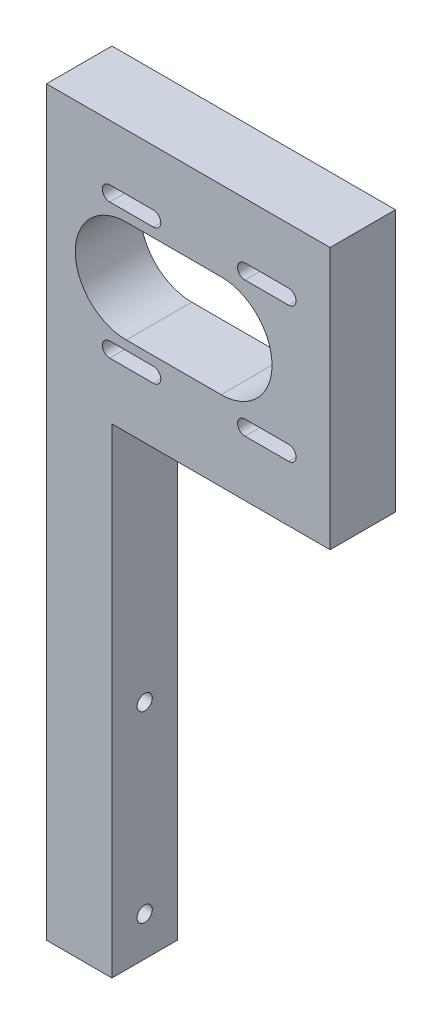
ISO-10303-21;
HEADER;
FILE_DESCRIPTION(('STEP AP214'),'2;1');
FILE_NAME('part.step','',(''),(''),'','','');
FILE_SCHEMA(('AUTOMOTIVE_DESIGN { 1 0 10303 214 1 1 1 1 }'));
ENDSEC;
DATA;
#1=APPLICATION_CONTEXT('core data for automotive mechanical design processes');
#2=APPLICATION_PROTOCOL_DEFINITION('international standard','automotive_design',2000,#1);
#3=PRODUCT_CONTEXT('',#1,'mechanical');
#4=PRODUCT('Part','Part','',(#3));
#5=PRODUCT_RELATED_PRODUCT_CATEGORY('part','',(#4));
#6=PRODUCT_DEFINITION_FORMATION('','',#4);
#7=PRODUCT_DEFINITION_CONTEXT('part definition',#1,'design');
#8=PRODUCT_DEFINITION('design','',#6,#7);
#9=PRODUCT_DEFINITION_SHAPE('','',#8);
#10=(LENGTH_UNIT() NAMED_UNIT(*) SI_UNIT(.MILLI.,.METRE.));
#11=(NAMED_UNIT(*) PLANE_ANGLE_UNIT() SI_UNIT($,.RADIAN.));
#12=(NAMED_UNIT(*) SI_UNIT($,.STERADIAN.) SOLID_ANGLE_UNIT());
#13=UNCERTAINTY_MEASURE_WITH_UNIT(LENGTH_MEASURE(1.E-05),#10,'distance_accuracy_value','');
#14=(GEOMETRIC_REPRESENTATION_CONTEXT(3) GLOBAL_UNCERTAINTY_ASSIGNED_CONTEXT((#13)) GLOBAL_UNIT_ASSIGNED_CONTEXT((#10,
#11,#12)) REPRESENTATION_CONTEXT('',''));
#15=CARTESIAN_POINT('',(0.,0.,0.));
#16=DIRECTION('',(0.,0.,1.));
#17=DIRECTION('',(1.,0.,0.));
#18=AXIS2_PLACEMENT_3D('',#15,#16,#17);
#19=CARTESIAN_POINT('',(7.5,170.,-7.5));
#20=DIRECTION('',(-1.,0.,0.));
#21=DIRECTION('',(0.,0.,1.));
#22=AXIS2_PLACEMENT_3D('',#19,#20,#21);
#23=PLANE('',#22);
#24=CARTESIAN_POINT('',(7.5,9.,0.));
#25=DIRECTION('',(1.,0.,0.));
#26=DIRECTION('',(0.,0.,-1.));
#27=AXIS2_PLACEMENT_3D('',#24,#25,#26);
#28=CIRCLE('',#27,1.75);
#29=CARTESIAN_POINT('',(7.5,9.,-1.75));
#30=VERTEX_POINT('',#29);
#31=EDGE_CURVE('E418',#30,#30,#28,.T.);
#32=ORIENTED_EDGE('',*,*,#31,.F.);
#33=EDGE_LOOP('',(#32));
#34=FACE_BOUND('',#33,.T.);
#35=CARTESIAN_POINT('',(7.5,51.,0.));
#36=DIRECTION('',(1.,0.,0.));
#37=DIRECTION('',(0.,0.,-1.));
#38=AXIS2_PLACEMENT_3D('',#35,#36,#37);
#39=CIRCLE('',#38,1.75);
#40=CARTESIAN_POINT('',(7.5,51.,-1.75));
#41=VERTEX_POINT('',#40);
#42=EDGE_CURVE('E410',#41,#41,#39,.T.);
#43=ORIENTED_EDGE('',*,*,#42,.F.);
#44=EDGE_LOOP('',(#43));
#45=FACE_BOUND('',#44,.T.);
#46=DIRECTION('',(0.,0.,-1.));
#47=VECTOR('',#46,1.);
#48=CARTESIAN_POINT('',(7.5,110.,7.49999999999999));
#49=LINE('',#48,#47);
#50=CARTESIAN_POINT('',(7.5,110.,7.5));
#51=VERTEX_POINT('',#50);
#52=CARTESIAN_POINT('',(7.5,110.,-7.5));
#53=VERTEX_POINT('',#52);
#54=EDGE_CURVE('E382',#51,#53,#49,.T.);
#55=ORIENTED_EDGE('',*,*,#54,.F.);
#56=DIRECTION('',(0.,-1.,0.));
#57=VECTOR('',#56,1.);
#58=CARTESIAN_POINT('',(7.5,170.,7.5));
#59=LINE('',#58,#57);
#60=CARTESIAN_POINT('',(7.5,0.,7.5));
#61=VERTEX_POINT('',#60);
#62=EDGE_CURVE('E403',#51,#61,#59,.T.);
#63=ORIENTED_EDGE('',*,*,#62,.T.);
#64=DIRECTION('',(0.,0.,-1.));
#65=VECTOR('',#64,1.);
#66=CARTESIAN_POINT('',(7.5,0.,-7.5));
#67=LINE('',#66,#65);
#68=CARTESIAN_POINT('',(7.5,0.,-7.5));
#69=VERTEX_POINT('',#68);
#70=EDGE_CURVE('E423',#61,#69,#67,.T.);
#71=ORIENTED_EDGE('',*,*,#70,.T.);
#72=DIRECTION('',(0.,-1.,0.));
#73=VECTOR('',#72,1.);
#74=CARTESIAN_POINT('',(7.5,170.,-7.5));
#75=LINE('',#74,#73);
#76=EDGE_CURVE('E11',#53,#69,#75,.T.);
#77=ORIENTED_EDGE('',*,*,#76,.F.);
#78=EDGE_LOOP('',(#55,#63,#71,#77));
#79=FACE_BOUND('',#78,.T.);
#80=ADVANCED_FACE('F34',(#34,#45,#79),#23,.F.);
#81=CARTESIAN_POINT('',(7.5,170.,-7.5));
#82=DIRECTION('',(0.,0.,1.));
#83=DIRECTION('',(1.,0.,0.));
#84=AXIS2_PLACEMENT_3D('',#81,#82,#83);
#85=PLANE('',#84);
#86=DIRECTION('',(1.,0.,0.));
#87=VECTOR('',#86,1.);
#88=CARTESIAN_POINT('',(7.5,153.8,-7.5));
#89=LINE('',#88,#87);
#90=CARTESIAN_POINT('',(7.,153.8,-7.5));
#91=VERTEX_POINT('',#90);
#92=CARTESIAN_POINT('',(17.,153.8,-7.5));
#93=VERTEX_POINT('',#92);
#94=EDGE_CURVE('E238',#91,#93,#89,.T.);
#95=ORIENTED_EDGE('',*,*,#94,.T.);
#96=CARTESIAN_POINT('',(17.,155.5,-7.5));
#97=DIRECTION('',(0.,0.,1.));
#98=DIRECTION('',(1.,0.,0.));
#99=AXIS2_PLACEMENT_3D('',#96,#97,#98);
#100=CIRCLE('',#99,1.70000000000001);
#101=CARTESIAN_POINT('',(17.,157.2,-7.5));
#102=VERTEX_POINT('',#101);
#103=EDGE_CURVE('E241',#93,#102,#100,.T.);
#104=ORIENTED_EDGE('',*,*,#103,.T.);
#105=DIRECTION('',(-1.,0.,0.));
#106=VECTOR('',#105,1.);
#107=CARTESIAN_POINT('',(7.5,157.2,-7.5));
#108=LINE('',#107,#106);
#109=CARTESIAN_POINT('',(7.,157.2,-7.5));
#110=VERTEX_POINT('',#109);
#111=EDGE_CURVE('E233',#102,#110,#108,.T.);
#112=ORIENTED_EDGE('',*,*,#111,.T.);
#113=CARTESIAN_POINT('',(7.,155.5,-7.5));
#114=DIRECTION('',(0.,0.,1.));
#115=DIRECTION('',(1.,0.,0.));
#116=AXIS2_PLACEMENT_3D('',#113,#114,#115);
#117=CIRCLE('',#116,1.70000000000001);
#118=EDGE_CURVE('E213',#110,#91,#117,.T.);
#119=ORIENTED_EDGE('',*,*,#118,.T.);
#120=EDGE_LOOP('',(#95,#104,#112,#119));
#121=FACE_BOUND('',#120,.T.);
#122=DIRECTION('',(1.,0.,0.));
#123=VECTOR('',#122,1.);
#124=CARTESIAN_POINT('',(7.5,153.8,-7.5));
#125=LINE('',#124,#123);
#126=CARTESIAN_POINT('',(38.,153.8,-7.5));
#127=VERTEX_POINT('',#126);
#128=CARTESIAN_POINT('',(48.,153.8,-7.5));
#129=VERTEX_POINT('',#128);
#130=EDGE_CURVE('E270',#127,#129,#125,.T.);
#131=ORIENTED_EDGE('',*,*,#130,.T.);
#132=CARTESIAN_POINT('',(48.,155.5,-7.5));
#133=DIRECTION('',(0.,0.,1.));
#134=DIRECTION('',(1.,0.,0.));
#135=AXIS2_PLACEMENT_3D('',#132,#133,#134);
#136=CIRCLE('',#135,1.70000000000001);
#137=CARTESIAN_POINT('',(48.,157.2,-7.5));
#138=VERTEX_POINT('',#137);
#139=EDGE_CURVE('E273',#129,#138,#136,.T.);
#140=ORIENTED_EDGE('',*,*,#139,.T.);
#141=DIRECTION('',(-1.,0.,0.));
#142=VECTOR('',#141,1.);
#143=CARTESIAN_POINT('',(7.5,157.2,-7.5));
#144=LINE('',#143,#142);
#145=CARTESIAN_POINT('',(38.,157.2,-7.5));
#146=VERTEX_POINT('',#145);
#147=EDGE_CURVE('E258',#138,#146,#144,.T.);
#148=ORIENTED_EDGE('',*,*,#147,.T.);
#149=CARTESIAN_POINT('',(38.,155.5,-7.5));
#150=DIRECTION('',(0.,0.,1.));
#151=DIRECTION('',(1.,0.,0.));
#152=AXIS2_PLACEMENT_3D('',#149,#150,#151);
#153=CIRCLE('',#152,1.70000000000001);
#154=EDGE_CURVE('E267',#146,#127,#153,.T.);
#155=ORIENTED_EDGE('',*,*,#154,.T.);
#156=EDGE_LOOP('',(#131,#140,#148,#155));
#157=FACE_BOUND('',#156,.T.);
#158=DIRECTION('',(1.,0.,0.));
#159=VECTOR('',#158,1.);
#160=CARTESIAN_POINT('',(7.5,122.8,-7.5));
#161=LINE('',#160,#159);
#162=CARTESIAN_POINT('',(38.,122.8,-7.5));
#163=VERTEX_POINT('',#162);
#164=CARTESIAN_POINT('',(48.,122.8,-7.5));
#165=VERTEX_POINT('',#164);
#166=EDGE_CURVE('E302',#163,#165,#161,.T.);
#167=ORIENTED_EDGE('',*,*,#166,.T.);
#168=CARTESIAN_POINT('',(48.,124.5,-7.5));
#169=DIRECTION('',(0.,0.,1.));
#170=DIRECTION('',(1.,0.,0.));
#171=AXIS2_PLACEMENT_3D('',#168,#169,#170);
#172=CIRCLE('',#171,1.70000000000001);
#173=CARTESIAN_POINT('',(48.,126.2,-7.5));
#174=VERTEX_POINT('',#173);
#175=EDGE_CURVE('E305',#165,#174,#172,.T.);
#176=ORIENTED_EDGE('',*,*,#175,.T.);
#177=DIRECTION('',(-1.,0.,0.));
#178=VECTOR('',#177,1.);
#179=CARTESIAN_POINT('',(7.5,126.2,-7.5));
#180=LINE('',#179,#178);
#181=CARTESIAN_POINT('',(38.,126.2,-7.5));
#182=VERTEX_POINT('',#181);
#183=EDGE_CURVE('E290',#174,#182,#180,.T.);
#184=ORIENTED_EDGE('',*,*,#183,.T.);
#185=CARTESIAN_POINT('',(38.,124.5,-7.5));
#186=DIRECTION('',(0.,0.,1.));
#187=DIRECTION('',(1.,0.,0.));
#188=AXIS2_PLACEMENT_3D('',#185,#186,#187);
#189=CIRCLE('',#188,1.70000000000001);
#190=EDGE_CURVE('E299',#182,#163,#189,.T.);
#191=ORIENTED_EDGE('',*,*,#190,.T.);
#192=EDGE_LOOP('',(#167,#176,#184,#191));
#193=FACE_BOUND('',#192,.T.);
#194=DIRECTION('',(1.,0.,0.));
#195=VECTOR('',#194,1.);
#196=CARTESIAN_POINT('',(7.49999999999989,128.3,-7.5));
#197=LINE('',#196,#195);
#198=CARTESIAN_POINT('',(10.8,128.3,-7.5));
#199=VERTEX_POINT('',#198);
#200=CARTESIAN_POINT('',(32.5,128.3,-7.5));
#201=VERTEX_POINT('',#200);
#202=EDGE_CURVE('E334',#199,#201,#197,.T.);
#203=ORIENTED_EDGE('',*,*,#202,.T.);
#204=CARTESIAN_POINT('',(32.5,140.,-7.5));
#205=DIRECTION('',(0.,0.,1.));
#206=DIRECTION('',(1.,0.,0.));
#207=AXIS2_PLACEMENT_3D('',#204,#205,#206);
#208=CIRCLE('',#207,11.7);
#209=CARTESIAN_POINT('',(32.5,151.7,-7.5));
#210=VERTEX_POINT('',#209);
#211=EDGE_CURVE('E337',#201,#210,#208,.T.);
#212=ORIENTED_EDGE('',*,*,#211,.T.);
#213=DIRECTION('',(-1.,0.,0.));
#214=VECTOR('',#213,1.);
#215=CARTESIAN_POINT('',(7.50000000000005,151.7,-7.5));
#216=LINE('',#215,#214);
#217=CARTESIAN_POINT('',(10.8,151.7,-7.5));
#218=VERTEX_POINT('',#217);
#219=EDGE_CURVE('E322',#210,#218,#216,.T.);
#220=ORIENTED_EDGE('',*,*,#219,.T.);
#221=CARTESIAN_POINT('',(10.8,140.,-7.5));
#222=DIRECTION('',(0.,0.,1.));
#223=DIRECTION('',(1.,0.,0.));
#224=AXIS2_PLACEMENT_3D('',#221,#222,#223);
#225=CIRCLE('',#224,11.7);
#226=EDGE_CURVE('E331',#218,#199,#225,.T.);
#227=ORIENTED_EDGE('',*,*,#226,.T.);
#228=EDGE_LOOP('',(#203,#212,#220,#227));
#229=FACE_BOUND('',#228,.T.);
#230=DIRECTION('',(1.,0.,0.));
#231=VECTOR('',#230,1.);
#232=CARTESIAN_POINT('',(7.5,122.8,-7.5));
#233=LINE('',#232,#231);
#234=CARTESIAN_POINT('',(7.,122.8,-7.5));
#235=VERTEX_POINT('',#234);
#236=CARTESIAN_POINT('',(17.,122.8,-7.5));
#237=VERTEX_POINT('',#236);
#238=EDGE_CURVE('E366',#235,#237,#233,.T.);
#239=ORIENTED_EDGE('',*,*,#238,.T.);
#240=CARTESIAN_POINT('',(17.,124.5,-7.5));
#241=DIRECTION('',(0.,0.,1.));
#242=DIRECTION('',(1.,0.,0.));
#243=AXIS2_PLACEMENT_3D('',#240,#241,#242);
#244=CIRCLE('',#243,1.70000000000001);
#245=CARTESIAN_POINT('',(17.,126.2,-7.5));
#246=VERTEX_POINT('',#245);
#247=EDGE_CURVE('E369',#237,#246,#244,.T.);
#248=ORIENTED_EDGE('',*,*,#247,.T.);
#249=DIRECTION('',(-1.,0.,0.));
#250=VECTOR('',#249,1.);
#251=CARTESIAN_POINT('',(7.5,126.2,-7.5));
#252=LINE('',#251,#250);
#253=CARTESIAN_POINT('',(7.,126.2,-7.5));
#254=VERTEX_POINT('',#253);
#255=EDGE_CURVE('E354',#246,#254,#252,.T.);
#256=ORIENTED_EDGE('',*,*,#255,.T.);
#257=CARTESIAN_POINT('',(7.,124.5,-7.5));
#258=DIRECTION('',(0.,0.,1.));
#259=DIRECTION('',(1.,0.,0.));
#260=AXIS2_PLACEMENT_3D('',#257,#258,#259);
#261=CIRCLE('',#260,1.70000000000001);
#262=EDGE_CURVE('E363',#254,#235,#261,.T.);
#263=ORIENTED_EDGE('',*,*,#262,.T.);
#264=EDGE_LOOP('',(#239,#248,#256,#263));
#265=FACE_BOUND('',#264,.T.);
#266=DIRECTION('',(-1.,0.,0.));
#267=VECTOR('',#266,1.);
#268=CARTESIAN_POINT('',(7.5,170.,-7.5));
#269=LINE('',#268,#267);
#270=CARTESIAN_POINT('',(57.5,170.,-7.50000000000002));
#271=VERTEX_POINT('',#270);
#272=CARTESIAN_POINT('',(-7.5,170.,-7.5));
#273=VERTEX_POINT('',#272);
#274=EDGE_CURVE('E426',#271,#273,#269,.T.);
#275=ORIENTED_EDGE('',*,*,#274,.F.);
#276=DIRECTION('',(0.,1.,0.));
#277=VECTOR('',#276,1.);
#278=CARTESIAN_POINT('',(57.5,170.,-7.50000000000002));
#279=LINE('',#278,#277);
#280=CARTESIAN_POINT('',(57.5,110.,-7.50000000000002));
#281=VERTEX_POINT('',#280);
#282=EDGE_CURVE('E389',#281,#271,#279,.T.);
#283=ORIENTED_EDGE('',*,*,#282,.F.);
#284=DIRECTION('',(-1.,0.,0.));
#285=VECTOR('',#284,1.);
#286=CARTESIAN_POINT('',(57.5,110.,-7.50000000000002));
#287=LINE('',#286,#285);
#288=EDGE_CURVE('E394',#281,#53,#287,.T.);
#289=ORIENTED_EDGE('',*,*,#288,.T.);
#290=ORIENTED_EDGE('',*,*,#76,.T.);
#291=DIRECTION('',(-1.,0.,0.));
#292=VECTOR('',#291,1.);
#293=CARTESIAN_POINT('',(7.5,0.,-7.5));
#294=LINE('',#293,#292);
#295=CARTESIAN_POINT('',(-7.5,0.,-7.5));
#296=VERTEX_POINT('',#295);
#297=EDGE_CURVE('E435',#69,#296,#294,.T.);
#298=ORIENTED_EDGE('',*,*,#297,.T.);
#299=DIRECTION('',(0.,-1.,0.));
#300=VECTOR('',#299,1.);
#301=CARTESIAN_POINT('',(-7.5,170.,-7.5));
#302=LINE('',#301,#300);
#303=EDGE_CURVE('E42',#273,#296,#302,.T.);
#304=ORIENTED_EDGE('',*,*,#303,.F.);
#305=EDGE_LOOP('',(#275,#283,#289,#290,#298,#304));
#306=FACE_BOUND('',#305,.T.);
#307=ADVANCED_FACE('F472',(#121,#157,#193,#229,#265,#306),#85,.F.);
#308=CARTESIAN_POINT('',(-7.5,170.,-7.5));
#309=DIRECTION('',(1.,0.,0.));
#310=DIRECTION('',(0.,0.,-1.));
#311=AXIS2_PLACEMENT_3D('',#308,#309,#310);
#312=PLANE('',#311);
#313=CARTESIAN_POINT('',(-7.5,119.,0.));
#314=DIRECTION('',(-1.,0.,0.));
#315=DIRECTION('',(0.,0.,1.));
#316=AXIS2_PLACEMENT_3D('',#313,#314,#315);
#317=CIRCLE('',#316,4.05);
#318=CARTESIAN_POINT('',(-7.5,119.,4.05));
#319=VERTEX_POINT('',#318);
#320=EDGE_CURVE('E372',#319,#319,#317,.T.);
#321=ORIENTED_EDGE('',*,*,#320,.F.);
#322=EDGE_LOOP('',(#321));
#323=FACE_BOUND('',#322,.T.);
#324=CARTESIAN_POINT('',(-7.5,161.,0.));
#325=DIRECTION('',(-1.,0.,0.));
#326=DIRECTION('',(0.,0.,1.));
#327=AXIS2_PLACEMENT_3D('',#324,#325,#326);
#328=CIRCLE('',#327,4.05);
#329=CARTESIAN_POINT('',(-7.5,161.,4.05));
#330=VERTEX_POINT('',#329);
#331=EDGE_CURVE('E376',#330,#330,#328,.T.);
#332=ORIENTED_EDGE('',*,*,#331,.F.);
#333=EDGE_LOOP('',(#332));
#334=FACE_BOUND('',#333,.T.);
#335=CARTESIAN_POINT('',(-7.5,51.,0.));
#336=DIRECTION('',(1.,0.,0.));
#337=DIRECTION('',(0.,0.,-1.));
#338=AXIS2_PLACEMENT_3D('',#335,#336,#337);
#339=CIRCLE('',#338,1.75);
#340=CARTESIAN_POINT('',(-7.5,51.,-1.74999999999999));
#341=VERTEX_POINT('',#340);
#342=EDGE_CURVE('E397',#341,#341,#339,.T.);
#343=ORIENTED_EDGE('',*,*,#342,.T.);
#344=EDGE_LOOP('',(#343));
#345=FACE_BOUND('',#344,.T.);
#346=CARTESIAN_POINT('',(-7.5,9.,0.));
#347=DIRECTION('',(1.,0.,0.));
#348=DIRECTION('',(0.,0.,-1.));
#349=AXIS2_PLACEMENT_3D('',#346,#347,#348);
#350=CIRCLE('',#349,1.75);
#351=CARTESIAN_POINT('',(-7.5,9.,-1.74999999999999));
#352=VERTEX_POINT('',#351);
#353=EDGE_CURVE('E420',#352,#352,#350,.T.);
#354=ORIENTED_EDGE('',*,*,#353,.T.);
#355=EDGE_LOOP('',(#354));
#356=FACE_BOUND('',#355,.T.);
#357=DIRECTION('',(0.,0.,1.));
#358=VECTOR('',#357,1.);
#359=CARTESIAN_POINT('',(-7.5,0.,-7.5));
#360=LINE('',#359,#358);
#361=CARTESIAN_POINT('',(-7.5,0.,7.5));
#362=VERTEX_POINT('',#361);
#363=EDGE_CURVE('E437',#296,#362,#360,.T.);
#364=ORIENTED_EDGE('',*,*,#363,.T.);
#365=DIRECTION('',(0.,-1.,0.));
#366=VECTOR('',#365,1.);
#367=CARTESIAN_POINT('',(-7.5,170.,7.5));
#368=LINE('',#367,#366);
#369=CARTESIAN_POINT('',(-7.5,170.,7.5));
#370=VERTEX_POINT('',#369);
#371=EDGE_CURVE('E442',#370,#362,#368,.T.);
#372=ORIENTED_EDGE('',*,*,#371,.F.);
#373=DIRECTION('',(0.,0.,1.));
#374=VECTOR('',#373,1.);
#375=CARTESIAN_POINT('',(-7.5,170.,-7.5));
#376=LINE('',#375,#374);
#377=EDGE_CURVE('E428',#273,#370,#376,.T.);
#378=ORIENTED_EDGE('',*,*,#377,.F.);
#379=ORIENTED_EDGE('',*,*,#303,.T.);
#380=EDGE_LOOP('',(#364,#372,#378,#379));
#381=FACE_BOUND('',#380,.T.);
#382=ADVANCED_FACE('F452',(#323,#334,#345,#356,#381),#312,.F.);
#383=CARTESIAN_POINT('',(7.5,170.,7.5));
#384=DIRECTION('',(0.,0.,-1.));
#385=DIRECTION('',(-1.,0.,0.));
#386=AXIS2_PLACEMENT_3D('',#383,#384,#385);
#387=PLANE('',#386);
#388=DIRECTION('',(-1.,0.,0.));
#389=VECTOR('',#388,1.);
#390=CARTESIAN_POINT('',(17.,157.2,7.5));
#391=LINE('',#390,#389);
#392=CARTESIAN_POINT('',(17.,157.2,7.5));
#393=VERTEX_POINT('',#392);
#394=CARTESIAN_POINT('',(7.,157.2,7.5));
#395=VERTEX_POINT('',#394);
#396=EDGE_CURVE('E219',#393,#395,#391,.T.);
#397=ORIENTED_EDGE('',*,*,#396,.F.);
#398=CARTESIAN_POINT('',(17.,155.5,7.5));
#399=DIRECTION('',(0.,0.,1.));
#400=DIRECTION('',(1.,0.,0.));
#401=AXIS2_PLACEMENT_3D('',#398,#399,#400);
#402=CIRCLE('',#401,1.70000000000001);
#403=CARTESIAN_POINT('',(17.,153.8,7.5));
#404=VERTEX_POINT('',#403);
#405=EDGE_CURVE('E58',#404,#393,#402,.T.);
#406=ORIENTED_EDGE('',*,*,#405,.F.);
#407=DIRECTION('',(1.,0.,0.));
#408=VECTOR('',#407,1.);
#409=CARTESIAN_POINT('',(17.,153.8,7.5));
#410=LINE('',#409,#408);
#411=CARTESIAN_POINT('',(7.,153.8,7.5));
#412=VERTEX_POINT('',#411);
#413=EDGE_CURVE('E226',#412,#404,#410,.T.);
#414=ORIENTED_EDGE('',*,*,#413,.F.);
#415=CARTESIAN_POINT('',(7.,155.5,7.5));
#416=DIRECTION('',(0.,0.,1.));
#417=DIRECTION('',(1.,0.,0.));
#418=AXIS2_PLACEMENT_3D('',#415,#416,#417);
#419=CIRCLE('',#418,1.70000000000001);
#420=EDGE_CURVE('E210',#395,#412,#419,.T.);
#421=ORIENTED_EDGE('',*,*,#420,.F.);
#422=EDGE_LOOP('',(#397,#406,#414,#421));
#423=FACE_BOUND('',#422,.T.);
#424=DIRECTION('',(-1.,0.,0.));
#425=VECTOR('',#424,1.);
#426=CARTESIAN_POINT('',(48.,157.2,7.5));
#427=LINE('',#426,#425);
#428=CARTESIAN_POINT('',(48.,157.2,7.5));
#429=VERTEX_POINT('',#428);
#430=CARTESIAN_POINT('',(38.,157.2,7.5));
#431=VERTEX_POINT('',#430);
#432=EDGE_CURVE('E246',#429,#431,#427,.T.);
#433=ORIENTED_EDGE('',*,*,#432,.F.);
#434=CARTESIAN_POINT('',(48.,155.5,7.5));
#435=DIRECTION('',(0.,0.,1.));
#436=DIRECTION('',(1.,0.,0.));
#437=AXIS2_PLACEMENT_3D('',#434,#435,#436);
#438=CIRCLE('',#437,1.70000000000001);
#439=CARTESIAN_POINT('',(48.,153.8,7.5));
#440=VERTEX_POINT('',#439);
#441=EDGE_CURVE('E244',#440,#429,#438,.T.);
#442=ORIENTED_EDGE('',*,*,#441,.F.);
#443=DIRECTION('',(1.,0.,0.));
#444=VECTOR('',#443,1.);
#445=CARTESIAN_POINT('',(48.,153.8,7.5));
#446=LINE('',#445,#444);
#447=CARTESIAN_POINT('',(38.,153.8,7.5));
#448=VERTEX_POINT('',#447);
#449=EDGE_CURVE('E252',#448,#440,#446,.T.);
#450=ORIENTED_EDGE('',*,*,#449,.F.);
#451=CARTESIAN_POINT('',(38.,155.5,7.5));
#452=DIRECTION('',(0.,0.,1.));
#453=DIRECTION('',(1.,0.,0.));
#454=AXIS2_PLACEMENT_3D('',#451,#452,#453);
#455=CIRCLE('',#454,1.70000000000001);
#456=EDGE_CURVE('E249',#431,#448,#455,.T.);
#457=ORIENTED_EDGE('',*,*,#456,.F.);
#458=EDGE_LOOP('',(#433,#442,#450,#457));
#459=FACE_BOUND('',#458,.T.);
#460=DIRECTION('',(-1.,0.,0.));
#461=VECTOR('',#460,1.);
#462=CARTESIAN_POINT('',(48.,126.2,7.5));
#463=LINE('',#462,#461);
#464=CARTESIAN_POINT('',(48.,126.2,7.5));
#465=VERTEX_POINT('',#464);
#466=CARTESIAN_POINT('',(38.,126.2,7.5));
#467=VERTEX_POINT('',#466);
#468=EDGE_CURVE('E278',#465,#467,#463,.T.);
#469=ORIENTED_EDGE('',*,*,#468,.F.);
#470=CARTESIAN_POINT('',(48.,124.5,7.5));
#471=DIRECTION('',(0.,0.,1.));
#472=DIRECTION('',(1.,0.,0.));
#473=AXIS2_PLACEMENT_3D('',#470,#471,#472);
#474=CIRCLE('',#473,1.70000000000001);
#475=CARTESIAN_POINT('',(48.,122.8,7.5));
#476=VERTEX_POINT('',#475);
#477=EDGE_CURVE('E276',#476,#465,#474,.T.);
#478=ORIENTED_EDGE('',*,*,#477,.F.);
#479=DIRECTION('',(1.,0.,0.));
#480=VECTOR('',#479,1.);
#481=CARTESIAN_POINT('',(48.,122.8,7.5));
#482=LINE('',#481,#480);
#483=CARTESIAN_POINT('',(38.,122.8,7.5));
#484=VERTEX_POINT('',#483);
#485=EDGE_CURVE('E284',#484,#476,#482,.T.);
#486=ORIENTED_EDGE('',*,*,#485,.F.);
#487=CARTESIAN_POINT('',(38.,124.5,7.5));
#488=DIRECTION('',(0.,0.,1.));
#489=DIRECTION('',(1.,0.,0.));
#490=AXIS2_PLACEMENT_3D('',#487,#488,#489);
#491=CIRCLE('',#490,1.70000000000001);
#492=EDGE_CURVE('E281',#467,#484,#491,.T.);
#493=ORIENTED_EDGE('',*,*,#492,.F.);
#494=EDGE_LOOP('',(#469,#478,#486,#493));
#495=FACE_BOUND('',#494,.T.);
#496=DIRECTION('',(-1.,0.,0.));
#497=VECTOR('',#496,1.);
#498=CARTESIAN_POINT('',(32.5,151.7,7.5));
#499=LINE('',#498,#497);
#500=CARTESIAN_POINT('',(32.5,151.7,7.5));
#501=VERTEX_POINT('',#500);
#502=CARTESIAN_POINT('',(10.8,151.7,7.5));
#503=VERTEX_POINT('',#502);
#504=EDGE_CURVE('E310',#501,#503,#499,.T.);
#505=ORIENTED_EDGE('',*,*,#504,.F.);
#506=CARTESIAN_POINT('',(32.5,140.,7.5));
#507=DIRECTION('',(0.,0.,1.));
#508=DIRECTION('',(1.,0.,0.));
#509=AXIS2_PLACEMENT_3D('',#506,#507,#508);
#510=CIRCLE('',#509,11.7);
#511=CARTESIAN_POINT('',(32.5,128.3,7.5));
#512=VERTEX_POINT('',#511);
#513=EDGE_CURVE('E308',#512,#501,#510,.T.);
#514=ORIENTED_EDGE('',*,*,#513,.F.);
#515=DIRECTION('',(1.,0.,0.));
#516=VECTOR('',#515,1.);
#517=CARTESIAN_POINT('',(32.5,128.3,7.5));
#518=LINE('',#517,#516);
#519=CARTESIAN_POINT('',(10.8,128.3,7.5));
#520=VERTEX_POINT('',#519);
#521=EDGE_CURVE('E316',#520,#512,#518,.T.);
#522=ORIENTED_EDGE('',*,*,#521,.F.);
#523=CARTESIAN_POINT('',(10.8,140.,7.5));
#524=DIRECTION('',(0.,0.,1.));
#525=DIRECTION('',(1.,0.,0.));
#526=AXIS2_PLACEMENT_3D('',#523,#524,#525);
#527=CIRCLE('',#526,11.7);
#528=EDGE_CURVE('E313',#503,#520,#527,.T.);
#529=ORIENTED_EDGE('',*,*,#528,.F.);
#530=EDGE_LOOP('',(#505,#514,#522,#529));
#531=FACE_BOUND('',#530,.T.);
#532=DIRECTION('',(-1.,0.,0.));
#533=VECTOR('',#532,1.);
#534=CARTESIAN_POINT('',(17.,126.2,7.5));
#535=LINE('',#534,#533);
#536=CARTESIAN_POINT('',(17.,126.2,7.5));
#537=VERTEX_POINT('',#536);
#538=CARTESIAN_POINT('',(7.,126.2,7.5));
#539=VERTEX_POINT('',#538);
#540=EDGE_CURVE('E342',#537,#539,#535,.T.);
#541=ORIENTED_EDGE('',*,*,#540,.F.);
#542=CARTESIAN_POINT('',(17.,124.5,7.5));
#543=DIRECTION('',(0.,0.,1.));
#544=DIRECTION('',(1.,0.,0.));
#545=AXIS2_PLACEMENT_3D('',#542,#543,#544);
#546=CIRCLE('',#545,1.70000000000001);
#547=CARTESIAN_POINT('',(17.,122.8,7.5));
#548=VERTEX_POINT('',#547);
#549=EDGE_CURVE('E340',#548,#537,#546,.T.);
#550=ORIENTED_EDGE('',*,*,#549,.F.);
#551=DIRECTION('',(1.,0.,0.));
#552=VECTOR('',#551,1.);
#553=CARTESIAN_POINT('',(17.,122.8,7.5));
#554=LINE('',#553,#552);
#555=CARTESIAN_POINT('',(7.,122.8,7.5));
#556=VERTEX_POINT('',#555);
#557=EDGE_CURVE('E348',#556,#548,#554,.T.);
#558=ORIENTED_EDGE('',*,*,#557,.F.);
#559=CARTESIAN_POINT('',(7.,124.5,7.5));
#560=DIRECTION('',(0.,0.,1.));
#561=DIRECTION('',(1.,0.,0.));
#562=AXIS2_PLACEMENT_3D('',#559,#560,#561);
#563=CIRCLE('',#562,1.70000000000001);
#564=EDGE_CURVE('E345',#539,#556,#563,.T.);
#565=ORIENTED_EDGE('',*,*,#564,.F.);
#566=EDGE_LOOP('',(#541,#550,#558,#565));
#567=FACE_BOUND('',#566,.T.);
#568=DIRECTION('',(-1.,0.,0.));
#569=VECTOR('',#568,1.);
#570=CARTESIAN_POINT('',(57.5,110.,7.49999999999998));
#571=LINE('',#570,#569);
#572=CARTESIAN_POINT('',(57.5,110.,7.49999999999998));
#573=VERTEX_POINT('',#572);
#574=EDGE_CURVE('E407',#573,#51,#571,.T.);
#575=ORIENTED_EDGE('',*,*,#574,.F.);
#576=DIRECTION('',(0.,-1.,0.));
#577=VECTOR('',#576,1.);
#578=CARTESIAN_POINT('',(57.5,170.,7.49999999999998));
#579=LINE('',#578,#577);
#580=CARTESIAN_POINT('',(57.5,170.,7.49999999999998));
#581=VERTEX_POINT('',#580);
#582=EDGE_CURVE('E385',#581,#573,#579,.T.);
#583=ORIENTED_EDGE('',*,*,#582,.F.);
#584=DIRECTION('',(1.,0.,0.));
#585=VECTOR('',#584,1.);
#586=CARTESIAN_POINT('',(7.5,170.,7.5));
#587=LINE('',#586,#585);
#588=EDGE_CURVE('E431',#370,#581,#587,.T.);
#589=ORIENTED_EDGE('',*,*,#588,.F.);
#590=ORIENTED_EDGE('',*,*,#371,.T.);
#591=DIRECTION('',(1.,0.,0.));
#592=VECTOR('',#591,1.);
#593=CARTESIAN_POINT('',(7.5,0.,7.5));
#594=LINE('',#593,#592);
#595=EDGE_CURVE('E429',#362,#61,#594,.T.);
#596=ORIENTED_EDGE('',*,*,#595,.T.);
#597=ORIENTED_EDGE('',*,*,#62,.F.);
#598=EDGE_LOOP('',(#575,#583,#589,#590,#596,#597));
#599=FACE_BOUND('',#598,.T.);
#600=ADVANCED_FACE('F223',(#423,#459,#495,#531,#567,#599),#387,.F.);
#601=CARTESIAN_POINT('',(7.5,170.,7.5));
#602=DIRECTION('',(0.,-1.,0.));
#603=DIRECTION('',(0.,0.,-1.));
#604=AXIS2_PLACEMENT_3D('',#601,#602,#603);
#605=PLANE('',#604);
#606=ORIENTED_EDGE('',*,*,#588,.T.);
#607=DIRECTION('',(0.,0.,1.));
#608=VECTOR('',#607,1.);
#609=CARTESIAN_POINT('',(57.5,170.,7.49999999999998));
#610=LINE('',#609,#608);
#611=EDGE_CURVE('E391',#271,#581,#610,.T.);
#612=ORIENTED_EDGE('',*,*,#611,.F.);
#613=ORIENTED_EDGE('',*,*,#274,.T.);
#614=ORIENTED_EDGE('',*,*,#377,.T.);
#615=EDGE_LOOP('',(#606,#612,#613,#614));
#616=FACE_BOUND('',#615,.T.);
#617=ADVANCED_FACE('F467',(#616),#605,.F.);
#618=CARTESIAN_POINT('',(7.5,0.,7.5));
#619=DIRECTION('',(0.,-1.,0.));
#620=DIRECTION('',(0.,0.,-1.));
#621=AXIS2_PLACEMENT_3D('',#618,#619,#620);
#622=PLANE('',#621);
#623=ORIENTED_EDGE('',*,*,#70,.F.);
#624=ORIENTED_EDGE('',*,*,#595,.F.);
#625=ORIENTED_EDGE('',*,*,#363,.F.);
#626=ORIENTED_EDGE('',*,*,#297,.F.);
#627=EDGE_LOOP('',(#623,#624,#625,#626));
#628=FACE_BOUND('',#627,.T.);
#629=ADVANCED_FACE('F460',(#628),#622,.T.);
#630=CARTESIAN_POINT('',(-7.5,9.,0.));
#631=DIRECTION('',(1.,0.,0.));
#632=DIRECTION('',(0.,0.,-1.));
#633=AXIS2_PLACEMENT_3D('',#630,#631,#632);
#634=CYLINDRICAL_SURFACE('',#633,1.75);
#635=ORIENTED_EDGE('',*,*,#353,.F.);
#636=EDGE_LOOP('',(#635));
#637=FACE_BOUND('',#636,.T.);
#638=ORIENTED_EDGE('',*,*,#31,.T.);
#639=EDGE_LOOP('',(#638));
#640=FACE_BOUND('',#639,.T.);
#641=ADVANCED_FACE('F488',(#637,#640),#634,.F.);
#642=CARTESIAN_POINT('',(-7.5,51.,0.));
#643=DIRECTION('',(1.,0.,0.));
#644=DIRECTION('',(0.,0.,-1.));
#645=AXIS2_PLACEMENT_3D('',#642,#643,#644);
#646=CYLINDRICAL_SURFACE('',#645,1.75);
#647=ORIENTED_EDGE('',*,*,#342,.F.);
#648=EDGE_LOOP('',(#647));
#649=FACE_BOUND('',#648,.T.);
#650=ORIENTED_EDGE('',*,*,#42,.T.);
#651=EDGE_LOOP('',(#650));
#652=FACE_BOUND('',#651,.T.);
#653=ADVANCED_FACE('F493',(#649,#652),#646,.F.);
#654=CARTESIAN_POINT('',(57.5,110.,7.49999999999998));
#655=DIRECTION('',(0.,1.,0.));
#656=DIRECTION('',(0.,0.,1.));
#657=AXIS2_PLACEMENT_3D('',#654,#655,#656);
#658=PLANE('',#657);
#659=ORIENTED_EDGE('',*,*,#54,.T.);
#660=ORIENTED_EDGE('',*,*,#288,.F.);
#661=DIRECTION('',(0.,0.,-1.));
#662=VECTOR('',#661,1.);
#663=CARTESIAN_POINT('',(57.5,110.,7.49999999999998));
#664=LINE('',#663,#662);
#665=EDGE_CURVE('E387',#573,#281,#664,.T.);
#666=ORIENTED_EDGE('',*,*,#665,.F.);
#667=ORIENTED_EDGE('',*,*,#574,.T.);
#668=EDGE_LOOP('',(#659,#660,#666,#667));
#669=FACE_BOUND('',#668,.T.);
#670=ADVANCED_FACE('F497',(#669),#658,.F.);
#671=CARTESIAN_POINT('',(57.5,110.,7.49999999999998));
#672=DIRECTION('',(1.,0.,0.));
#673=DIRECTION('',(0.,0.,-1.));
#674=AXIS2_PLACEMENT_3D('',#671,#672,#673);
#675=PLANE('',#674);
#676=ORIENTED_EDGE('',*,*,#282,.T.);
#677=ORIENTED_EDGE('',*,*,#611,.T.);
#678=ORIENTED_EDGE('',*,*,#582,.T.);
#679=ORIENTED_EDGE('',*,*,#665,.T.);
#680=EDGE_LOOP('',(#676,#677,#678,#679));
#681=FACE_BOUND('',#680,.T.);
#682=ADVANCED_FACE('F469',(#681),#675,.T.);
#683=CARTESIAN_POINT('',(2.5,161.,0.));
#684=DIRECTION('',(-1.,0.,0.));
#685=DIRECTION('',(0.,0.,1.));
#686=AXIS2_PLACEMENT_3D('',#683,#684,#685);
#687=CYLINDRICAL_SURFACE('',#686,4.05);
#688=CARTESIAN_POINT('',(2.5,161.,0.));
#689=DIRECTION('',(-1.,0.,0.));
#690=DIRECTION('',(0.,0.,1.));
#691=AXIS2_PLACEMENT_3D('',#688,#689,#690);
#692=CIRCLE('',#691,4.05);
#693=CARTESIAN_POINT('',(2.5,161.,4.05));
#694=VERTEX_POINT('',#693);
#695=EDGE_CURVE('E379',#694,#694,#692,.T.);
#696=ORIENTED_EDGE('',*,*,#695,.F.);
#697=EDGE_LOOP('',(#696));
#698=FACE_BOUND('',#697,.T.);
#699=ORIENTED_EDGE('',*,*,#331,.T.);
#700=EDGE_LOOP('',(#699));
#701=FACE_BOUND('',#700,.T.);
#702=ADVANCED_FACE('F503',(#698,#701),#687,.F.);
#703=CARTESIAN_POINT('',(2.5,161.,0.));
#704=DIRECTION('',(-1.,0.,0.));
#705=DIRECTION('',(0.,0.,1.));
#706=AXIS2_PLACEMENT_3D('',#703,#704,#705);
#707=PLANE('',#706);
#708=ORIENTED_EDGE('',*,*,#695,.T.);
#709=EDGE_LOOP('',(#708));
#710=FACE_BOUND('',#709,.T.);
#711=ADVANCED_FACE('F506',(#710),#707,.T.);
#712=CARTESIAN_POINT('',(2.5,119.,0.));
#713=DIRECTION('',(-1.,0.,0.));
#714=DIRECTION('',(0.,0.,1.));
#715=AXIS2_PLACEMENT_3D('',#712,#713,#714);
#716=CYLINDRICAL_SURFACE('',#715,4.05);
#717=CARTESIAN_POINT('',(2.5,119.,0.));
#718=DIRECTION('',(-1.,0.,0.));
#719=DIRECTION('',(0.,0.,1.));
#720=AXIS2_PLACEMENT_3D('',#717,#718,#719);
#721=CIRCLE('',#720,4.05);
#722=CARTESIAN_POINT('',(2.5,119.,4.05));
#723=VERTEX_POINT('',#722);
#724=EDGE_CURVE('E373',#723,#723,#721,.T.);
#725=ORIENTED_EDGE('',*,*,#724,.F.);
#726=EDGE_LOOP('',(#725));
#727=FACE_BOUND('',#726,.T.);
#728=ORIENTED_EDGE('',*,*,#320,.T.);
#729=EDGE_LOOP('',(#728));
#730=FACE_BOUND('',#729,.T.);
#731=ADVANCED_FACE('F510',(#727,#730),#716,.F.);
#732=CARTESIAN_POINT('',(2.5,119.,0.));
#733=DIRECTION('',(-1.,0.,0.));
#734=DIRECTION('',(0.,0.,1.));
#735=AXIS2_PLACEMENT_3D('',#732,#733,#734);
#736=PLANE('',#735);
#737=ORIENTED_EDGE('',*,*,#724,.T.);
#738=EDGE_LOOP('',(#737));
#739=FACE_BOUND('',#738,.T.);
#740=ADVANCED_FACE('F514',(#739),#736,.T.);
#741=CARTESIAN_POINT('',(17.,124.5,-7.50005));
#742=DIRECTION('',(0.,0.,1.));
#743=DIRECTION('',(1.,0.,0.));
#744=AXIS2_PLACEMENT_3D('',#741,#742,#743);
#745=CYLINDRICAL_SURFACE('',#744,1.70000000000001);
#746=DIRECTION('',(0.,0.,1.));
#747=VECTOR('',#746,1.);
#748=CARTESIAN_POINT('',(17.,122.8,-7.50005));
#749=LINE('',#748,#747);
#750=EDGE_CURVE('E352',#237,#548,#749,.T.);
#751=ORIENTED_EDGE('',*,*,#750,.T.);
#752=ORIENTED_EDGE('',*,*,#549,.T.);
#753=DIRECTION('',(0.,0.,1.));
#754=VECTOR('',#753,1.);
#755=CARTESIAN_POINT('',(17.,126.2,-7.50005));
#756=LINE('',#755,#754);
#757=EDGE_CURVE('E351',#246,#537,#756,.T.);
#758=ORIENTED_EDGE('',*,*,#757,.F.);
#759=ORIENTED_EDGE('',*,*,#247,.F.);
#760=EDGE_LOOP('',(#751,#752,#758,#759));
#761=FACE_BOUND('',#760,.T.);
#762=ADVANCED_FACE('F518',(#761),#745,.F.);
#763=CARTESIAN_POINT('',(17.,122.8,-7.50005));
#764=DIRECTION('',(0.,-1.,0.));
#765=DIRECTION('',(0.,0.,-1.));
#766=AXIS2_PLACEMENT_3D('',#763,#764,#765);
#767=PLANE('',#766);
#768=DIRECTION('',(0.,0.,1.));
#769=VECTOR('',#768,1.);
#770=CARTESIAN_POINT('',(7.,122.8,-7.50005));
#771=LINE('',#770,#769);
#772=EDGE_CURVE('E355',#235,#556,#771,.T.);
#773=ORIENTED_EDGE('',*,*,#772,.T.);
#774=ORIENTED_EDGE('',*,*,#557,.T.);
#775=ORIENTED_EDGE('',*,*,#750,.F.);
#776=ORIENTED_EDGE('',*,*,#238,.F.);
#777=EDGE_LOOP('',(#773,#774,#775,#776));
#778=FACE_BOUND('',#777,.T.);
#779=ADVANCED_FACE('F522',(#778),#767,.F.);
#780=CARTESIAN_POINT('',(7.,124.5,-7.50005));
#781=DIRECTION('',(0.,0.,1.));
#782=DIRECTION('',(1.,0.,0.));
#783=AXIS2_PLACEMENT_3D('',#780,#781,#782);
#784=CYLINDRICAL_SURFACE('',#783,1.70000000000001);
#785=DIRECTION('',(0.,0.,1.));
#786=VECTOR('',#785,1.);
#787=CARTESIAN_POINT('',(7.,126.2,-7.50005));
#788=LINE('',#787,#786);
#789=EDGE_CURVE('E357',#254,#539,#788,.T.);
#790=ORIENTED_EDGE('',*,*,#789,.T.);
#791=ORIENTED_EDGE('',*,*,#564,.T.);
#792=ORIENTED_EDGE('',*,*,#772,.F.);
#793=ORIENTED_EDGE('',*,*,#262,.F.);
#794=EDGE_LOOP('',(#790,#791,#792,#793));
#795=FACE_BOUND('',#794,.T.);
#796=ADVANCED_FACE('F528',(#795),#784,.F.);
#797=CARTESIAN_POINT('',(17.,126.2,-7.50005));
#798=DIRECTION('',(0.,1.,0.));
#799=DIRECTION('',(0.,0.,1.));
#800=AXIS2_PLACEMENT_3D('',#797,#798,#799);
#801=PLANE('',#800);
#802=ORIENTED_EDGE('',*,*,#757,.T.);
#803=ORIENTED_EDGE('',*,*,#540,.T.);
#804=ORIENTED_EDGE('',*,*,#789,.F.);
#805=ORIENTED_EDGE('',*,*,#255,.F.);
#806=EDGE_LOOP('',(#802,#803,#804,#805));
#807=FACE_BOUND('',#806,.T.);
#808=ADVANCED_FACE('F524',(#807),#801,.F.);
#809=CARTESIAN_POINT('',(32.5,140.,-7.50005));
#810=DIRECTION('',(0.,0.,1.));
#811=DIRECTION('',(1.,0.,0.));
#812=AXIS2_PLACEMENT_3D('',#809,#810,#811);
#813=CYLINDRICAL_SURFACE('',#812,11.7);
#814=DIRECTION('',(0.,0.,1.));
#815=VECTOR('',#814,1.);
#816=CARTESIAN_POINT('',(32.5,128.3,-7.50005));
#817=LINE('',#816,#815);
#818=EDGE_CURVE('E320',#201,#512,#817,.T.);
#819=ORIENTED_EDGE('',*,*,#818,.T.);
#820=ORIENTED_EDGE('',*,*,#513,.T.);
#821=DIRECTION('',(0.,0.,1.));
#822=VECTOR('',#821,1.);
#823=CARTESIAN_POINT('',(32.5,151.7,-7.50005));
#824=LINE('',#823,#822);
#825=EDGE_CURVE('E319',#210,#501,#824,.T.);
#826=ORIENTED_EDGE('',*,*,#825,.F.);
#827=ORIENTED_EDGE('',*,*,#211,.F.);
#828=EDGE_LOOP('',(#819,#820,#826,#827));
#829=FACE_BOUND('',#828,.T.);
#830=ADVANCED_FACE('F527',(#829),#813,.F.);
#831=CARTESIAN_POINT('',(32.5,128.3,-7.50005));
#832=DIRECTION('',(0.,-1.,0.));
#833=DIRECTION('',(1.,0.,0.));
#834=AXIS2_PLACEMENT_3D('',#831,#832,#833);
#835=PLANE('',#834);
#836=DIRECTION('',(0.,0.,1.));
#837=VECTOR('',#836,1.);
#838=CARTESIAN_POINT('',(10.8,128.3,-7.50005));
#839=LINE('',#838,#837);
#840=EDGE_CURVE('E323',#199,#520,#839,.T.);
#841=ORIENTED_EDGE('',*,*,#840,.T.);
#842=ORIENTED_EDGE('',*,*,#521,.T.);
#843=ORIENTED_EDGE('',*,*,#818,.F.);
#844=ORIENTED_EDGE('',*,*,#202,.F.);
#845=EDGE_LOOP('',(#841,#842,#843,#844));
#846=FACE_BOUND('',#845,.T.);
#847=ADVANCED_FACE('F538',(#846),#835,.F.);
#848=CARTESIAN_POINT('',(10.8,140.,-7.50005));
#849=DIRECTION('',(0.,0.,1.));
#850=DIRECTION('',(1.,0.,0.));
#851=AXIS2_PLACEMENT_3D('',#848,#849,#850);
#852=CYLINDRICAL_SURFACE('',#851,11.7);
#853=DIRECTION('',(0.,0.,1.));
#854=VECTOR('',#853,1.);
#855=CARTESIAN_POINT('',(10.8,151.7,-7.50005));
#856=LINE('',#855,#854);
#857=EDGE_CURVE('E325',#218,#503,#856,.T.);
#858=ORIENTED_EDGE('',*,*,#857,.T.);
#859=ORIENTED_EDGE('',*,*,#528,.T.);
#860=ORIENTED_EDGE('',*,*,#840,.F.);
#861=ORIENTED_EDGE('',*,*,#226,.F.);
#862=EDGE_LOOP('',(#858,#859,#860,#861));
#863=FACE_BOUND('',#862,.T.);
#864=ADVANCED_FACE('F544',(#863),#852,.F.);
#865=CARTESIAN_POINT('',(32.5,151.7,-7.50005));
#866=DIRECTION('',(0.,1.,0.));
#867=DIRECTION('',(-1.,0.,0.));
#868=AXIS2_PLACEMENT_3D('',#865,#866,#867);
#869=PLANE('',#868);
#870=ORIENTED_EDGE('',*,*,#825,.T.);
#871=ORIENTED_EDGE('',*,*,#504,.T.);
#872=ORIENTED_EDGE('',*,*,#857,.F.);
#873=ORIENTED_EDGE('',*,*,#219,.F.);
#874=EDGE_LOOP('',(#870,#871,#872,#873));
#875=FACE_BOUND('',#874,.T.);
#876=ADVANCED_FACE('F540',(#875),#869,.F.);
#877=CARTESIAN_POINT('',(48.,124.5,-7.50005));
#878=DIRECTION('',(0.,0.,1.));
#879=DIRECTION('',(1.,0.,0.));
#880=AXIS2_PLACEMENT_3D('',#877,#878,#879);
#881=CYLINDRICAL_SURFACE('',#880,1.70000000000001);
#882=DIRECTION('',(0.,0.,1.));
#883=VECTOR('',#882,1.);
#884=CARTESIAN_POINT('',(48.,122.8,-7.50005));
#885=LINE('',#884,#883);
#886=EDGE_CURVE('E288',#165,#476,#885,.T.);
#887=ORIENTED_EDGE('',*,*,#886,.T.);
#888=ORIENTED_EDGE('',*,*,#477,.T.);
#889=DIRECTION('',(0.,0.,1.));
#890=VECTOR('',#889,1.);
#891=CARTESIAN_POINT('',(48.,126.2,-7.50005));
#892=LINE('',#891,#890);
#893=EDGE_CURVE('E287',#174,#465,#892,.T.);
#894=ORIENTED_EDGE('',*,*,#893,.F.);
#895=ORIENTED_EDGE('',*,*,#175,.F.);
#896=EDGE_LOOP('',(#887,#888,#894,#895));
#897=FACE_BOUND('',#896,.T.);
#898=ADVANCED_FACE('F543',(#897),#881,.F.);
#899=CARTESIAN_POINT('',(48.,122.8,-7.50005));
#900=DIRECTION('',(0.,-1.,0.));
#901=DIRECTION('',(0.,0.,-1.));
#902=AXIS2_PLACEMENT_3D('',#899,#900,#901);
#903=PLANE('',#902);
#904=DIRECTION('',(0.,0.,1.));
#905=VECTOR('',#904,1.);
#906=CARTESIAN_POINT('',(38.,122.8,-7.50005));
#907=LINE('',#906,#905);
#908=EDGE_CURVE('E291',#163,#484,#907,.T.);
#909=ORIENTED_EDGE('',*,*,#908,.T.);
#910=ORIENTED_EDGE('',*,*,#485,.T.);
#911=ORIENTED_EDGE('',*,*,#886,.F.);
#912=ORIENTED_EDGE('',*,*,#166,.F.);
#913=EDGE_LOOP('',(#909,#910,#911,#912));
#914=FACE_BOUND('',#913,.T.);
#915=ADVANCED_FACE('F554',(#914),#903,.F.);
#916=CARTESIAN_POINT('',(38.,124.5,-7.50005));
#917=DIRECTION('',(0.,0.,1.));
#918=DIRECTION('',(1.,0.,0.));
#919=AXIS2_PLACEMENT_3D('',#916,#917,#918);
#920=CYLINDRICAL_SURFACE('',#919,1.70000000000001);
#921=DIRECTION('',(0.,0.,1.));
#922=VECTOR('',#921,1.);
#923=CARTESIAN_POINT('',(38.,126.2,-7.50005));
#924=LINE('',#923,#922);
#925=EDGE_CURVE('E293',#182,#467,#924,.T.);
#926=ORIENTED_EDGE('',*,*,#925,.T.);
#927=ORIENTED_EDGE('',*,*,#492,.T.);
#928=ORIENTED_EDGE('',*,*,#908,.F.);
#929=ORIENTED_EDGE('',*,*,#190,.F.);
#930=EDGE_LOOP('',(#926,#927,#928,#929));
#931=FACE_BOUND('',#930,.T.);
#932=ADVANCED_FACE('F560',(#931),#920,.F.);
#933=CARTESIAN_POINT('',(48.,126.2,-7.50005));
#934=DIRECTION('',(0.,1.,0.));
#935=DIRECTION('',(0.,0.,1.));
#936=AXIS2_PLACEMENT_3D('',#933,#934,#935);
#937=PLANE('',#936);
#938=ORIENTED_EDGE('',*,*,#893,.T.);
#939=ORIENTED_EDGE('',*,*,#468,.T.);
#940=ORIENTED_EDGE('',*,*,#925,.F.);
#941=ORIENTED_EDGE('',*,*,#183,.F.);
#942=EDGE_LOOP('',(#938,#939,#940,#941));
#943=FACE_BOUND('',#942,.T.);
#944=ADVANCED_FACE('F556',(#943),#937,.F.);
#945=CARTESIAN_POINT('',(48.,155.5,-7.50005));
#946=DIRECTION('',(0.,0.,1.));
#947=DIRECTION('',(1.,0.,0.));
#948=AXIS2_PLACEMENT_3D('',#945,#946,#947);
#949=CYLINDRICAL_SURFACE('',#948,1.70000000000001);
#950=DIRECTION('',(0.,0.,1.));
#951=VECTOR('',#950,1.);
#952=CARTESIAN_POINT('',(48.,153.8,-7.50005));
#953=LINE('',#952,#951);
#954=EDGE_CURVE('E256',#129,#440,#953,.T.);
#955=ORIENTED_EDGE('',*,*,#954,.T.);
#956=ORIENTED_EDGE('',*,*,#441,.T.);
#957=DIRECTION('',(0.,0.,1.));
#958=VECTOR('',#957,1.);
#959=CARTESIAN_POINT('',(48.,157.2,-7.50005));
#960=LINE('',#959,#958);
#961=EDGE_CURVE('E255',#138,#429,#960,.T.);
#962=ORIENTED_EDGE('',*,*,#961,.F.);
#963=ORIENTED_EDGE('',*,*,#139,.F.);
#964=EDGE_LOOP('',(#955,#956,#962,#963));
#965=FACE_BOUND('',#964,.T.);
#966=ADVANCED_FACE('F559',(#965),#949,.F.);
#967=CARTESIAN_POINT('',(48.,153.8,-7.50005));
#968=DIRECTION('',(0.,-1.,0.));
#969=DIRECTION('',(0.,0.,-1.));
#970=AXIS2_PLACEMENT_3D('',#967,#968,#969);
#971=PLANE('',#970);
#972=DIRECTION('',(0.,0.,1.));
#973=VECTOR('',#972,1.);
#974=CARTESIAN_POINT('',(38.,153.8,-7.50005));
#975=LINE('',#974,#973);
#976=EDGE_CURVE('E259',#127,#448,#975,.T.);
#977=ORIENTED_EDGE('',*,*,#976,.T.);
#978=ORIENTED_EDGE('',*,*,#449,.T.);
#979=ORIENTED_EDGE('',*,*,#954,.F.);
#980=ORIENTED_EDGE('',*,*,#130,.F.);
#981=EDGE_LOOP('',(#977,#978,#979,#980));
#982=FACE_BOUND('',#981,.T.);
#983=ADVANCED_FACE('F570',(#982),#971,.F.);
#984=CARTESIAN_POINT('',(38.,155.5,-7.50005));
#985=DIRECTION('',(0.,0.,1.));
#986=DIRECTION('',(1.,0.,0.));
#987=AXIS2_PLACEMENT_3D('',#984,#985,#986);
#988=CYLINDRICAL_SURFACE('',#987,1.70000000000001);
#989=DIRECTION('',(0.,0.,1.));
#990=VECTOR('',#989,1.);
#991=CARTESIAN_POINT('',(38.,157.2,-7.50005));
#992=LINE('',#991,#990);
#993=EDGE_CURVE('E261',#146,#431,#992,.T.);
#994=ORIENTED_EDGE('',*,*,#993,.T.);
#995=ORIENTED_EDGE('',*,*,#456,.T.);
#996=ORIENTED_EDGE('',*,*,#976,.F.);
#997=ORIENTED_EDGE('',*,*,#154,.F.);
#998=EDGE_LOOP('',(#994,#995,#996,#997));
#999=FACE_BOUND('',#998,.T.);
#1000=ADVANCED_FACE('F576',(#999),#988,.F.);
#1001=CARTESIAN_POINT('',(48.,157.2,-7.50005));
#1002=DIRECTION('',(0.,1.,0.));
#1003=DIRECTION('',(0.,0.,1.));
#1004=AXIS2_PLACEMENT_3D('',#1001,#1002,#1003);
#1005=PLANE('',#1004);
#1006=ORIENTED_EDGE('',*,*,#961,.T.);
#1007=ORIENTED_EDGE('',*,*,#432,.T.);
#1008=ORIENTED_EDGE('',*,*,#993,.F.);
#1009=ORIENTED_EDGE('',*,*,#147,.F.);
#1010=EDGE_LOOP('',(#1006,#1007,#1008,#1009));
#1011=FACE_BOUND('',#1010,.T.);
#1012=ADVANCED_FACE('F572',(#1011),#1005,.F.);
#1013=CARTESIAN_POINT('',(17.,155.5,-7.50005));
#1014=DIRECTION('',(0.,0.,1.));
#1015=DIRECTION('',(1.,0.,0.));
#1016=AXIS2_PLACEMENT_3D('',#1013,#1014,#1015);
#1017=CYLINDRICAL_SURFACE('',#1016,1.70000000000001);
#1018=DIRECTION('',(0.,0.,1.));
#1019=VECTOR('',#1018,1.);
#1020=CARTESIAN_POINT('',(17.,153.8,-7.50005));
#1021=LINE('',#1020,#1019);
#1022=EDGE_CURVE('E231',#93,#404,#1021,.T.);
#1023=ORIENTED_EDGE('',*,*,#1022,.T.);
#1024=ORIENTED_EDGE('',*,*,#405,.T.);
#1025=DIRECTION('',(0.,0.,1.));
#1026=VECTOR('',#1025,1.);
#1027=CARTESIAN_POINT('',(17.,157.2,-7.50005));
#1028=LINE('',#1027,#1026);
#1029=EDGE_CURVE('E216',#102,#393,#1028,.T.);
#1030=ORIENTED_EDGE('',*,*,#1029,.F.);
#1031=ORIENTED_EDGE('',*,*,#103,.F.);
#1032=EDGE_LOOP('',(#1023,#1024,#1030,#1031));
#1033=FACE_BOUND('',#1032,.T.);
#1034=ADVANCED_FACE('F575',(#1033),#1017,.F.);
#1035=CARTESIAN_POINT('',(17.,153.8,-7.50005));
#1036=DIRECTION('',(0.,-1.,0.));
#1037=DIRECTION('',(0.,0.,-1.));
#1038=AXIS2_PLACEMENT_3D('',#1035,#1036,#1037);
#1039=PLANE('',#1038);
#1040=DIRECTION('',(0.,0.,1.));
#1041=VECTOR('',#1040,1.);
#1042=CARTESIAN_POINT('',(7.,153.8,-7.50005));
#1043=LINE('',#1042,#1041);
#1044=EDGE_CURVE('E215',#91,#412,#1043,.T.);
#1045=ORIENTED_EDGE('',*,*,#1044,.T.);
#1046=ORIENTED_EDGE('',*,*,#413,.T.);
#1047=ORIENTED_EDGE('',*,*,#1022,.F.);
#1048=ORIENTED_EDGE('',*,*,#94,.F.);
#1049=EDGE_LOOP('',(#1045,#1046,#1047,#1048));
#1050=FACE_BOUND('',#1049,.T.);
#1051=ADVANCED_FACE('F586',(#1050),#1039,.F.);
#1052=CARTESIAN_POINT('',(7.,155.5,-7.50005));
#1053=DIRECTION('',(0.,0.,1.));
#1054=DIRECTION('',(1.,0.,0.));
#1055=AXIS2_PLACEMENT_3D('',#1052,#1053,#1054);
#1056=CYLINDRICAL_SURFACE('',#1055,1.70000000000001);
#1057=DIRECTION('',(0.,0.,1.));
#1058=VECTOR('',#1057,1.);
#1059=CARTESIAN_POINT('',(7.,157.2,-7.50005));
#1060=LINE('',#1059,#1058);
#1061=EDGE_CURVE('E50',#110,#395,#1060,.T.);
#1062=ORIENTED_EDGE('',*,*,#1061,.T.);
#1063=ORIENTED_EDGE('',*,*,#420,.T.);
#1064=ORIENTED_EDGE('',*,*,#1044,.F.);
#1065=ORIENTED_EDGE('',*,*,#118,.F.);
#1066=EDGE_LOOP('',(#1062,#1063,#1064,#1065));
#1067=FACE_BOUND('',#1066,.T.);
#1068=ADVANCED_FACE('F207',(#1067),#1056,.F.);
#1069=CARTESIAN_POINT('',(17.,157.2,-7.50005));
#1070=DIRECTION('',(0.,1.,0.));
#1071=DIRECTION('',(0.,0.,1.));
#1072=AXIS2_PLACEMENT_3D('',#1069,#1070,#1071);
#1073=PLANE('',#1072);
#1074=ORIENTED_EDGE('',*,*,#1029,.T.);
#1075=ORIENTED_EDGE('',*,*,#396,.T.);
#1076=ORIENTED_EDGE('',*,*,#1061,.F.);
#1077=ORIENTED_EDGE('',*,*,#111,.F.);
#1078=EDGE_LOOP('',(#1074,#1075,#1076,#1077));
#1079=FACE_BOUND('',#1078,.T.);
#1080=ADVANCED_FACE('F220',(#1079),#1073,.F.);
#1081=CLOSED_SHELL('',(#80,#307,#382,#600,#617,#629,#641,#653,#670,#682,#702,#711,#731,#740,
#762,#779,#796,#808,#830,#847,#864,#876,#898,#915,#932,#944,#966,#983,#1000,#1012,#1034,#1051,
#1068,#1080));
#1082=MANIFOLD_SOLID_BREP('B2',#1081);
#1083=ADVANCED_BREP_SHAPE_REPRESENTATION('',(#18,#1082),#14);
#1084=SHAPE_DEFINITION_REPRESENTATION(#9,#1083);
ENDSEC;
END-ISO-10303-21;
